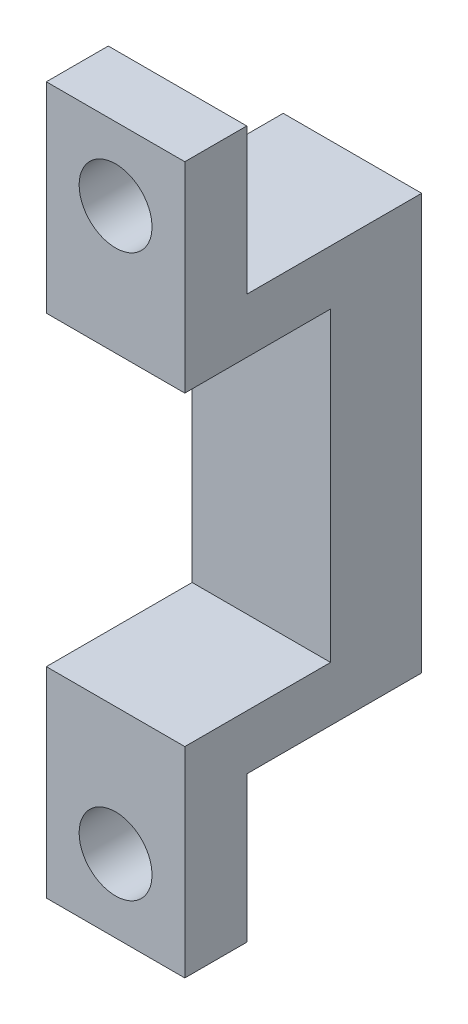
ISO-10303-21;
HEADER;
FILE_DESCRIPTION(('STEP AP214'),'2;1');
FILE_NAME('part.step','',(''),(''),'','','');
FILE_SCHEMA(('AUTOMOTIVE_DESIGN { 1 0 10303 214 1 1 1 1 }'));
ENDSEC;
DATA;
#1=APPLICATION_CONTEXT('core data for automotive mechanical design processes');
#2=APPLICATION_PROTOCOL_DEFINITION('international standard','automotive_design',2000,#1);
#3=PRODUCT_CONTEXT('',#1,'mechanical');
#4=PRODUCT('Part','Part','',(#3));
#5=PRODUCT_RELATED_PRODUCT_CATEGORY('part','',(#4));
#6=PRODUCT_DEFINITION_FORMATION('','',#4);
#7=PRODUCT_DEFINITION_CONTEXT('part definition',#1,'design');
#8=PRODUCT_DEFINITION('design','',#6,#7);
#9=PRODUCT_DEFINITION_SHAPE('','',#8);
#10=(LENGTH_UNIT() NAMED_UNIT(*) SI_UNIT(.MILLI.,.METRE.));
#11=(NAMED_UNIT(*) PLANE_ANGLE_UNIT() SI_UNIT($,.RADIAN.));
#12=(NAMED_UNIT(*) SI_UNIT($,.STERADIAN.) SOLID_ANGLE_UNIT());
#13=UNCERTAINTY_MEASURE_WITH_UNIT(LENGTH_MEASURE(1.E-05),#10,'distance_accuracy_value','');
#14=(GEOMETRIC_REPRESENTATION_CONTEXT(3) GLOBAL_UNCERTAINTY_ASSIGNED_CONTEXT((#13)) GLOBAL_UNIT_ASSIGNED_CONTEXT((#10,
#11,#12)) REPRESENTATION_CONTEXT('',''));
#15=CARTESIAN_POINT('',(0.,0.,0.));
#16=DIRECTION('',(0.,0.,1.));
#17=DIRECTION('',(1.,0.,0.));
#18=AXIS2_PLACEMENT_3D('',#15,#16,#17);
#19=CARTESIAN_POINT('',(-9.5,28.5,12.5));
#20=DIRECTION('',(0.,-1.,0.));
#21=DIRECTION('',(0.,0.,-1.));
#22=AXIS2_PLACEMENT_3D('',#19,#20,#21);
#23=PLANE('',#22);
#24=DIRECTION('',(-1.,0.,0.));
#25=VECTOR('',#24,1.);
#26=CARTESIAN_POINT('',(-9.5,28.5,24.));
#27=LINE('',#26,#25);
#28=CARTESIAN_POINT('',(9.5,28.5,24.));
#29=VERTEX_POINT('',#28);
#30=CARTESIAN_POINT('',(-9.5,28.5,24.));
#31=VERTEX_POINT('',#30);
#32=EDGE_CURVE('E52',#29,#31,#27,.T.);
#33=ORIENTED_EDGE('',*,*,#32,.F.);
#34=DIRECTION('',(0.,0.,-1.));
#35=VECTOR('',#34,1.);
#36=CARTESIAN_POINT('',(9.5,28.5,12.5));
#37=LINE('',#36,#35);
#38=CARTESIAN_POINT('',(9.5,28.5,0.));
#39=VERTEX_POINT('',#38);
#40=EDGE_CURVE('E45',#29,#39,#37,.T.);
#41=ORIENTED_EDGE('',*,*,#40,.T.);
#42=DIRECTION('',(-1.,0.,0.));
#43=VECTOR('',#42,1.);
#44=CARTESIAN_POINT('',(-9.5,28.5,0.));
#45=LINE('',#44,#43);
#46=CARTESIAN_POINT('',(-9.5,28.5,0.));
#47=VERTEX_POINT('',#46);
#48=EDGE_CURVE('E218',#39,#47,#45,.T.);
#49=ORIENTED_EDGE('',*,*,#48,.T.);
#50=DIRECTION('',(0.,0.,-1.));
#51=VECTOR('',#50,1.);
#52=CARTESIAN_POINT('',(-9.5,28.5,12.5));
#53=LINE('',#52,#51);
#54=EDGE_CURVE('E223',#31,#47,#53,.T.);
#55=ORIENTED_EDGE('',*,*,#54,.F.);
#56=EDGE_LOOP('',(#33,#41,#49,#55));
#57=FACE_BOUND('',#56,.T.);
#58=ADVANCED_FACE('F37',(#57),#23,.F.);
#59=CARTESIAN_POINT('',(9.50000000000001,-28.5,12.5));
#60=DIRECTION('',(0.,1.,0.));
#61=DIRECTION('',(-1.,0.,0.));
#62=AXIS2_PLACEMENT_3D('',#59,#60,#61);
#63=PLANE('',#62);
#64=DIRECTION('',(1.,0.,0.));
#65=VECTOR('',#64,1.);
#66=CARTESIAN_POINT('',(-9.5,-28.5,24.));
#67=LINE('',#66,#65);
#68=CARTESIAN_POINT('',(-9.5,-28.5,24.));
#69=VERTEX_POINT('',#68);
#70=CARTESIAN_POINT('',(9.50000000000001,-28.5,24.));
#71=VERTEX_POINT('',#70);
#72=EDGE_CURVE('E60',#69,#71,#67,.T.);
#73=ORIENTED_EDGE('',*,*,#72,.F.);
#74=DIRECTION('',(0.,0.,-1.));
#75=VECTOR('',#74,1.);
#76=CARTESIAN_POINT('',(-9.5,-28.5,12.5));
#77=LINE('',#76,#75);
#78=CARTESIAN_POINT('',(-9.5,-28.5,0.));
#79=VERTEX_POINT('',#78);
#80=EDGE_CURVE('E212',#69,#79,#77,.T.);
#81=ORIENTED_EDGE('',*,*,#80,.T.);
#82=DIRECTION('',(1.,0.,0.));
#83=VECTOR('',#82,1.);
#84=CARTESIAN_POINT('',(9.50000000000001,-28.5,0.));
#85=LINE('',#84,#83);
#86=CARTESIAN_POINT('',(9.50000000000001,-28.5,0.));
#87=VERTEX_POINT('',#86);
#88=EDGE_CURVE('E206',#79,#87,#85,.T.);
#89=ORIENTED_EDGE('',*,*,#88,.T.);
#90=DIRECTION('',(0.,0.,-1.));
#91=VECTOR('',#90,1.);
#92=CARTESIAN_POINT('',(9.50000000000001,-28.5,12.5));
#93=LINE('',#92,#91);
#94=EDGE_CURVE('E11',#71,#87,#93,.T.);
#95=ORIENTED_EDGE('',*,*,#94,.F.);
#96=EDGE_LOOP('',(#73,#81,#89,#95));
#97=FACE_BOUND('',#96,.T.);
#98=ADVANCED_FACE('F39',(#97),#63,.F.);
#99=CARTESIAN_POINT('',(0.,0.,12.5));
#100=DIRECTION('',(0.,0.,-1.));
#101=DIRECTION('',(-1.,0.,0.));
#102=AXIS2_PLACEMENT_3D('',#99,#100,#101);
#103=PLANE('',#102);
#104=DIRECTION('',(1.,0.,0.));
#105=VECTOR('',#104,1.);
#106=CARTESIAN_POINT('',(9.50000000000001,21.,12.5));
#107=LINE('',#106,#105);
#108=CARTESIAN_POINT('',(-9.5,21.,12.5));
#109=VERTEX_POINT('',#108);
#110=CARTESIAN_POINT('',(9.5,21.,12.5));
#111=VERTEX_POINT('',#110);
#112=EDGE_CURVE('E136',#109,#111,#107,.T.);
#113=ORIENTED_EDGE('',*,*,#112,.F.);
#114=DIRECTION('',(0.,-1.,0.));
#115=VECTOR('',#114,1.);
#116=CARTESIAN_POINT('',(-9.5,-28.5,12.5));
#117=LINE('',#116,#115);
#118=CARTESIAN_POINT('',(-9.5,-21.,12.5));
#119=VERTEX_POINT('',#118);
#120=EDGE_CURVE('E209',#109,#119,#117,.T.);
#121=ORIENTED_EDGE('',*,*,#120,.T.);
#122=DIRECTION('',(-1.,0.,0.));
#123=VECTOR('',#122,1.);
#124=CARTESIAN_POINT('',(-9.5,-21.,12.5));
#125=LINE('',#124,#123);
#126=CARTESIAN_POINT('',(9.50000000000001,-21.,12.5));
#127=VERTEX_POINT('',#126);
#128=EDGE_CURVE('E189',#127,#119,#125,.T.);
#129=ORIENTED_EDGE('',*,*,#128,.F.);
#130=DIRECTION('',(0.,1.,0.));
#131=VECTOR('',#130,1.);
#132=CARTESIAN_POINT('',(9.5,28.5,12.5));
#133=LINE('',#132,#131);
#134=EDGE_CURVE('E207',#127,#111,#133,.T.);
#135=ORIENTED_EDGE('',*,*,#134,.T.);
#136=EDGE_LOOP('',(#113,#121,#129,#135));
#137=FACE_BOUND('',#136,.T.);
#138=ADVANCED_FACE('F243',(#137),#103,.F.);
#139=CARTESIAN_POINT('',(9.5,28.5,12.5));
#140=DIRECTION('',(-1.,0.,0.));
#141=DIRECTION('',(0.,-1.,0.));
#142=AXIS2_PLACEMENT_3D('',#139,#140,#141);
#143=PLANE('',#142);
#144=DIRECTION('',(0.,1.,0.));
#145=VECTOR('',#144,1.);
#146=CARTESIAN_POINT('',(9.5,28.5,0.));
#147=LINE('',#146,#145);
#148=EDGE_CURVE('E215',#87,#39,#147,.T.);
#149=ORIENTED_EDGE('',*,*,#148,.T.);
#150=ORIENTED_EDGE('',*,*,#40,.F.);
#151=DIRECTION('',(0.,-1.,0.));
#152=VECTOR('',#151,1.);
#153=CARTESIAN_POINT('',(9.50000000000001,48.5,24.));
#154=LINE('',#153,#152);
#155=CARTESIAN_POINT('',(9.50000000000001,48.5,24.));
#156=VERTEX_POINT('',#155);
#157=EDGE_CURVE('E162',#156,#29,#154,.T.);
#158=ORIENTED_EDGE('',*,*,#157,.F.);
#159=DIRECTION('',(0.,0.,-1.));
#160=VECTOR('',#159,1.);
#161=CARTESIAN_POINT('',(9.50000000000001,48.5,24.));
#162=LINE('',#161,#160);
#163=CARTESIAN_POINT('',(9.50000000000001,48.5,32.5));
#164=VERTEX_POINT('',#163);
#165=EDGE_CURVE('E146',#164,#156,#162,.T.);
#166=ORIENTED_EDGE('',*,*,#165,.F.);
#167=DIRECTION('',(0.,1.,0.));
#168=VECTOR('',#167,1.);
#169=CARTESIAN_POINT('',(9.50000000000001,28.5,32.5));
#170=LINE('',#169,#168);
#171=CARTESIAN_POINT('',(9.50000000000001,21.,32.5));
#172=VERTEX_POINT('',#171);
#173=EDGE_CURVE('E143',#172,#164,#170,.T.);
#174=ORIENTED_EDGE('',*,*,#173,.F.);
#175=DIRECTION('',(0.,0.,-1.));
#176=VECTOR('',#175,1.);
#177=CARTESIAN_POINT('',(9.50000000000001,21.,32.5));
#178=LINE('',#177,#176);
#179=EDGE_CURVE('E184',#172,#111,#178,.T.);
#180=ORIENTED_EDGE('',*,*,#179,.T.);
#181=ORIENTED_EDGE('',*,*,#134,.F.);
#182=DIRECTION('',(0.,0.,-1.));
#183=VECTOR('',#182,1.);
#184=CARTESIAN_POINT('',(9.50000000000001,-21.,32.5));
#185=LINE('',#184,#183);
#186=CARTESIAN_POINT('',(9.50000000000001,-21.,32.5));
#187=VERTEX_POINT('',#186);
#188=EDGE_CURVE('E203',#187,#127,#185,.T.);
#189=ORIENTED_EDGE('',*,*,#188,.F.);
#190=DIRECTION('',(0.,1.,0.));
#191=VECTOR('',#190,1.);
#192=CARTESIAN_POINT('',(9.50000000000001,-21.,32.5));
#193=LINE('',#192,#191);
#194=CARTESIAN_POINT('',(9.50000000000002,-48.5,32.5));
#195=VERTEX_POINT('',#194);
#196=EDGE_CURVE('E194',#195,#187,#193,.T.);
#197=ORIENTED_EDGE('',*,*,#196,.F.);
#198=DIRECTION('',(0.,0.,1.));
#199=VECTOR('',#198,1.);
#200=CARTESIAN_POINT('',(9.50000000000002,-48.5,24.));
#201=LINE('',#200,#199);
#202=CARTESIAN_POINT('',(9.50000000000002,-48.5,24.));
#203=VERTEX_POINT('',#202);
#204=EDGE_CURVE('E170',#203,#195,#201,.T.);
#205=ORIENTED_EDGE('',*,*,#204,.F.);
#206=DIRECTION('',(0.,1.,0.));
#207=VECTOR('',#206,1.);
#208=CARTESIAN_POINT('',(9.50000000000002,-48.5,24.));
#209=LINE('',#208,#207);
#210=EDGE_CURVE('E176',#203,#71,#209,.T.);
#211=ORIENTED_EDGE('',*,*,#210,.T.);
#212=ORIENTED_EDGE('',*,*,#94,.T.);
#213=EDGE_LOOP('',(#149,#150,#158,#166,#174,#180,#181,#189,#197,#205,#211,#212));
#214=FACE_BOUND('',#213,.T.);
#215=ADVANCED_FACE('F229',(#214),#143,.F.);
#216=CARTESIAN_POINT('',(-9.5,-28.5,12.5));
#217=DIRECTION('',(1.,0.,0.));
#218=DIRECTION('',(0.,1.,0.));
#219=AXIS2_PLACEMENT_3D('',#216,#217,#218);
#220=PLANE('',#219);
#221=DIRECTION('',(0.,-1.,0.));
#222=VECTOR('',#221,1.);
#223=CARTESIAN_POINT('',(-9.5,-28.5,0.));
#224=LINE('',#223,#222);
#225=EDGE_CURVE('E210',#47,#79,#224,.T.);
#226=ORIENTED_EDGE('',*,*,#225,.T.);
#227=ORIENTED_EDGE('',*,*,#80,.F.);
#228=DIRECTION('',(0.,1.,0.));
#229=VECTOR('',#228,1.);
#230=CARTESIAN_POINT('',(-9.49999999999999,-48.5,24.));
#231=LINE('',#230,#229);
#232=CARTESIAN_POINT('',(-9.49999999999999,-48.5,24.));
#233=VERTEX_POINT('',#232);
#234=EDGE_CURVE('E180',#233,#69,#231,.T.);
#235=ORIENTED_EDGE('',*,*,#234,.F.);
#236=DIRECTION('',(0.,0.,-1.));
#237=VECTOR('',#236,1.);
#238=CARTESIAN_POINT('',(-9.49999999999999,-48.5,32.5));
#239=LINE('',#238,#237);
#240=CARTESIAN_POINT('',(-9.49999999999999,-48.5,32.5));
#241=VERTEX_POINT('',#240);
#242=EDGE_CURVE('E165',#241,#233,#239,.T.);
#243=ORIENTED_EDGE('',*,*,#242,.F.);
#244=DIRECTION('',(0.,-1.,0.));
#245=VECTOR('',#244,1.);
#246=CARTESIAN_POINT('',(-9.5,-28.5,32.5));
#247=LINE('',#246,#245);
#248=CARTESIAN_POINT('',(-9.5,-21.,32.5));
#249=VERTEX_POINT('',#248);
#250=EDGE_CURVE('E192',#249,#241,#247,.T.);
#251=ORIENTED_EDGE('',*,*,#250,.F.);
#252=DIRECTION('',(0.,0.,-1.));
#253=VECTOR('',#252,1.);
#254=CARTESIAN_POINT('',(-9.5,-21.,32.5));
#255=LINE('',#254,#253);
#256=EDGE_CURVE('E198',#249,#119,#255,.T.);
#257=ORIENTED_EDGE('',*,*,#256,.T.);
#258=ORIENTED_EDGE('',*,*,#120,.F.);
#259=DIRECTION('',(0.,0.,-1.));
#260=VECTOR('',#259,1.);
#261=CARTESIAN_POINT('',(-9.5,21.,32.5));
#262=LINE('',#261,#260);
#263=CARTESIAN_POINT('',(-9.5,21.,32.5));
#264=VERTEX_POINT('',#263);
#265=EDGE_CURVE('E134',#264,#109,#262,.T.);
#266=ORIENTED_EDGE('',*,*,#265,.F.);
#267=DIRECTION('',(0.,-1.,0.));
#268=VECTOR('',#267,1.);
#269=CARTESIAN_POINT('',(-9.5,21.,32.5));
#270=LINE('',#269,#268);
#271=CARTESIAN_POINT('',(-9.5,48.5,32.5));
#272=VERTEX_POINT('',#271);
#273=EDGE_CURVE('E126',#272,#264,#270,.T.);
#274=ORIENTED_EDGE('',*,*,#273,.F.);
#275=DIRECTION('',(0.,0.,1.));
#276=VECTOR('',#275,1.);
#277=CARTESIAN_POINT('',(-9.5,48.5,32.5));
#278=LINE('',#277,#276);
#279=CARTESIAN_POINT('',(-9.5,48.5,24.));
#280=VERTEX_POINT('',#279);
#281=EDGE_CURVE('E132',#280,#272,#278,.T.);
#282=ORIENTED_EDGE('',*,*,#281,.F.);
#283=DIRECTION('',(0.,-1.,0.));
#284=VECTOR('',#283,1.);
#285=CARTESIAN_POINT('',(-9.5,48.5,24.));
#286=LINE('',#285,#284);
#287=EDGE_CURVE('E159',#280,#31,#286,.T.);
#288=ORIENTED_EDGE('',*,*,#287,.T.);
#289=ORIENTED_EDGE('',*,*,#54,.T.);
#290=EDGE_LOOP('',(#226,#227,#235,#243,#251,#257,#258,#266,#274,#282,#288,#289));
#291=FACE_BOUND('',#290,.T.);
#292=ADVANCED_FACE('F129',(#291),#220,.F.);
#293=CARTESIAN_POINT('',(0.,0.,0.));
#294=DIRECTION('',(0.,0.,-1.));
#295=DIRECTION('',(-1.,0.,0.));
#296=AXIS2_PLACEMENT_3D('',#293,#294,#295);
#297=PLANE('',#296);
#298=ORIENTED_EDGE('',*,*,#88,.F.);
#299=ORIENTED_EDGE('',*,*,#225,.F.);
#300=ORIENTED_EDGE('',*,*,#48,.F.);
#301=ORIENTED_EDGE('',*,*,#148,.F.);
#302=EDGE_LOOP('',(#298,#299,#300,#301));
#303=FACE_BOUND('',#302,.T.);
#304=ADVANCED_FACE('F232',(#303),#297,.T.);
#305=CARTESIAN_POINT('',(-9.5,-21.,32.5));
#306=DIRECTION('',(0.,-1.,0.));
#307=DIRECTION('',(0.,0.,-1.));
#308=AXIS2_PLACEMENT_3D('',#305,#306,#307);
#309=PLANE('',#308);
#310=ORIENTED_EDGE('',*,*,#128,.T.);
#311=ORIENTED_EDGE('',*,*,#256,.F.);
#312=DIRECTION('',(-1.,0.,0.));
#313=VECTOR('',#312,1.);
#314=CARTESIAN_POINT('',(-9.5,-21.,32.5));
#315=LINE('',#314,#313);
#316=EDGE_CURVE('E196',#187,#249,#315,.T.);
#317=ORIENTED_EDGE('',*,*,#316,.F.);
#318=ORIENTED_EDGE('',*,*,#188,.T.);
#319=EDGE_LOOP('',(#310,#311,#317,#318));
#320=FACE_BOUND('',#319,.T.);
#321=ADVANCED_FACE('F246',(#320),#309,.F.);
#322=CARTESIAN_POINT('',(0.,0.,32.5));
#323=DIRECTION('',(0.,0.,-1.));
#324=DIRECTION('',(-1.,0.,0.));
#325=AXIS2_PLACEMENT_3D('',#322,#323,#324);
#326=PLANE('',#325);
#327=CARTESIAN_POINT('',(0.,-38.5,32.5));
#328=DIRECTION('',(0.,0.,-1.));
#329=DIRECTION('',(-1.,0.,0.));
#330=AXIS2_PLACEMENT_3D('',#327,#328,#329);
#331=CIRCLE('',#330,5.00000000000001);
#332=CARTESIAN_POINT('',(-5.00000000000001,-38.5,32.5));
#333=VERTEX_POINT('',#332);
#334=EDGE_CURVE('E153',#333,#333,#331,.T.);
#335=ORIENTED_EDGE('',*,*,#334,.T.);
#336=EDGE_LOOP('',(#335));
#337=FACE_BOUND('',#336,.T.);
#338=ORIENTED_EDGE('',*,*,#250,.T.);
#339=DIRECTION('',(-1.,0.,0.));
#340=VECTOR('',#339,1.);
#341=CARTESIAN_POINT('',(9.50000000000002,-48.5,32.5));
#342=LINE('',#341,#340);
#343=EDGE_CURVE('E173',#195,#241,#342,.T.);
#344=ORIENTED_EDGE('',*,*,#343,.F.);
#345=ORIENTED_EDGE('',*,*,#196,.T.);
#346=ORIENTED_EDGE('',*,*,#316,.T.);
#347=EDGE_LOOP('',(#338,#344,#345,#346));
#348=FACE_BOUND('',#347,.T.);
#349=ADVANCED_FACE('F252',(#337,#348),#326,.F.);
#350=CARTESIAN_POINT('',(9.50000000000001,21.,32.5));
#351=DIRECTION('',(0.,1.,0.));
#352=DIRECTION('',(-1.,0.,0.));
#353=AXIS2_PLACEMENT_3D('',#350,#351,#352);
#354=PLANE('',#353);
#355=ORIENTED_EDGE('',*,*,#112,.T.);
#356=ORIENTED_EDGE('',*,*,#179,.F.);
#357=DIRECTION('',(1.,0.,0.));
#358=VECTOR('',#357,1.);
#359=CARTESIAN_POINT('',(9.50000000000001,21.,32.5));
#360=LINE('',#359,#358);
#361=EDGE_CURVE('E137',#264,#172,#360,.T.);
#362=ORIENTED_EDGE('',*,*,#361,.F.);
#363=ORIENTED_EDGE('',*,*,#265,.T.);
#364=EDGE_LOOP('',(#355,#356,#362,#363));
#365=FACE_BOUND('',#364,.T.);
#366=ADVANCED_FACE('F240',(#365),#354,.F.);
#367=CARTESIAN_POINT('',(0.,0.,32.5));
#368=DIRECTION('',(0.,0.,-1.));
#369=DIRECTION('',(-1.,0.,0.));
#370=AXIS2_PLACEMENT_3D('',#367,#368,#369);
#371=PLANE('',#370);
#372=CARTESIAN_POINT('',(0.,38.5,32.5));
#373=DIRECTION('',(0.,0.,-1.));
#374=DIRECTION('',(-1.,0.,0.));
#375=AXIS2_PLACEMENT_3D('',#372,#373,#374);
#376=CIRCLE('',#375,5.);
#377=CARTESIAN_POINT('',(-5.,38.5,32.5));
#378=VERTEX_POINT('',#377);
#379=EDGE_CURVE('E302',#378,#378,#376,.T.);
#380=ORIENTED_EDGE('',*,*,#379,.T.);
#381=EDGE_LOOP('',(#380));
#382=FACE_BOUND('',#381,.T.);
#383=ORIENTED_EDGE('',*,*,#273,.T.);
#384=ORIENTED_EDGE('',*,*,#361,.T.);
#385=ORIENTED_EDGE('',*,*,#173,.T.);
#386=DIRECTION('',(1.,0.,0.));
#387=VECTOR('',#386,1.);
#388=CARTESIAN_POINT('',(9.50000000000001,48.5,32.5));
#389=LINE('',#388,#387);
#390=EDGE_CURVE('E140',#272,#164,#389,.T.);
#391=ORIENTED_EDGE('',*,*,#390,.F.);
#392=EDGE_LOOP('',(#383,#384,#385,#391));
#393=FACE_BOUND('',#392,.T.);
#394=ADVANCED_FACE('F141',(#382,#393),#371,.F.);
#395=CARTESIAN_POINT('',(-9.49999999999999,-48.5,24.));
#396=DIRECTION('',(0.,0.,1.));
#397=DIRECTION('',(1.,0.,0.));
#398=AXIS2_PLACEMENT_3D('',#395,#396,#397);
#399=PLANE('',#398);
#400=CARTESIAN_POINT('',(0.,-38.5,24.));
#401=DIRECTION('',(0.,0.,-1.));
#402=DIRECTION('',(-1.,0.,0.));
#403=AXIS2_PLACEMENT_3D('',#400,#401,#402);
#404=CIRCLE('',#403,5.00000000000001);
#405=CARTESIAN_POINT('',(-5.00000000000001,-38.5,24.));
#406=VERTEX_POINT('',#405);
#407=EDGE_CURVE('E307',#406,#406,#404,.T.);
#408=ORIENTED_EDGE('',*,*,#407,.F.);
#409=EDGE_LOOP('',(#408));
#410=FACE_BOUND('',#409,.T.);
#411=ORIENTED_EDGE('',*,*,#72,.T.);
#412=ORIENTED_EDGE('',*,*,#210,.F.);
#413=DIRECTION('',(1.,0.,0.));
#414=VECTOR('',#413,1.);
#415=CARTESIAN_POINT('',(-9.49999999999999,-48.5,24.));
#416=LINE('',#415,#414);
#417=EDGE_CURVE('E168',#233,#203,#416,.T.);
#418=ORIENTED_EDGE('',*,*,#417,.F.);
#419=ORIENTED_EDGE('',*,*,#234,.T.);
#420=EDGE_LOOP('',(#411,#412,#418,#419));
#421=FACE_BOUND('',#420,.T.);
#422=ADVANCED_FACE('F258',(#410,#421),#399,.F.);
#423=CARTESIAN_POINT('',(0.,-48.5,0.));
#424=DIRECTION('',(0.,-1.,0.));
#425=DIRECTION('',(1.,0.,0.));
#426=AXIS2_PLACEMENT_3D('',#423,#424,#425);
#427=PLANE('',#426);
#428=ORIENTED_EDGE('',*,*,#242,.T.);
#429=ORIENTED_EDGE('',*,*,#417,.T.);
#430=ORIENTED_EDGE('',*,*,#204,.T.);
#431=ORIENTED_EDGE('',*,*,#343,.T.);
#432=EDGE_LOOP('',(#428,#429,#430,#431));
#433=FACE_BOUND('',#432,.T.);
#434=ADVANCED_FACE('F254',(#433),#427,.T.);
#435=CARTESIAN_POINT('',(-9.5,48.5,24.));
#436=DIRECTION('',(0.,0.,1.));
#437=DIRECTION('',(1.,0.,0.));
#438=AXIS2_PLACEMENT_3D('',#435,#436,#437);
#439=PLANE('',#438);
#440=CARTESIAN_POINT('',(0.,38.5,24.));
#441=DIRECTION('',(0.,0.,-1.));
#442=DIRECTION('',(-1.,0.,0.));
#443=AXIS2_PLACEMENT_3D('',#440,#441,#442);
#444=CIRCLE('',#443,5.);
#445=CARTESIAN_POINT('',(-5.,38.5,24.));
#446=VERTEX_POINT('',#445);
#447=EDGE_CURVE('E304',#446,#446,#444,.T.);
#448=ORIENTED_EDGE('',*,*,#447,.F.);
#449=EDGE_LOOP('',(#448));
#450=FACE_BOUND('',#449,.T.);
#451=ORIENTED_EDGE('',*,*,#32,.T.);
#452=ORIENTED_EDGE('',*,*,#287,.F.);
#453=DIRECTION('',(-1.,0.,0.));
#454=VECTOR('',#453,1.);
#455=CARTESIAN_POINT('',(-9.5,48.5,24.));
#456=LINE('',#455,#454);
#457=EDGE_CURVE('E150',#156,#280,#456,.T.);
#458=ORIENTED_EDGE('',*,*,#457,.F.);
#459=ORIENTED_EDGE('',*,*,#157,.T.);
#460=EDGE_LOOP('',(#451,#452,#458,#459));
#461=FACE_BOUND('',#460,.T.);
#462=ADVANCED_FACE('F235',(#450,#461),#439,.F.);
#463=CARTESIAN_POINT('',(0.,48.5,0.));
#464=DIRECTION('',(0.,-1.,0.));
#465=DIRECTION('',(0.,0.,-1.));
#466=AXIS2_PLACEMENT_3D('',#463,#464,#465);
#467=PLANE('',#466);
#468=ORIENTED_EDGE('',*,*,#281,.T.);
#469=ORIENTED_EDGE('',*,*,#390,.T.);
#470=ORIENTED_EDGE('',*,*,#165,.T.);
#471=ORIENTED_EDGE('',*,*,#457,.T.);
#472=EDGE_LOOP('',(#468,#469,#470,#471));
#473=FACE_BOUND('',#472,.T.);
#474=ADVANCED_FACE('F148',(#473),#467,.F.);
#475=CARTESIAN_POINT('',(0.,38.5,44.));
#476=DIRECTION('',(0.,0.,-1.));
#477=DIRECTION('',(-1.,0.,0.));
#478=AXIS2_PLACEMENT_3D('',#475,#476,#477);
#479=CYLINDRICAL_SURFACE('',#478,5.);
#480=ORIENTED_EDGE('',*,*,#447,.T.);
#481=EDGE_LOOP('',(#480));
#482=FACE_BOUND('',#481,.T.);
#483=ORIENTED_EDGE('',*,*,#379,.F.);
#484=EDGE_LOOP('',(#483));
#485=FACE_BOUND('',#484,.T.);
#486=ADVANCED_FACE('F314',(#482,#485),#479,.F.);
#487=CARTESIAN_POINT('',(0.,-38.5,44.));
#488=DIRECTION('',(0.,0.,-1.));
#489=DIRECTION('',(-1.,0.,0.));
#490=AXIS2_PLACEMENT_3D('',#487,#488,#489);
#491=CYLINDRICAL_SURFACE('',#490,5.00000000000001);
#492=ORIENTED_EDGE('',*,*,#407,.T.);
#493=EDGE_LOOP('',(#492));
#494=FACE_BOUND('',#493,.T.);
#495=ORIENTED_EDGE('',*,*,#334,.F.);
#496=EDGE_LOOP('',(#495));
#497=FACE_BOUND('',#496,.T.);
#498=ADVANCED_FACE('F312',(#494,#497),#491,.F.);
#499=CLOSED_SHELL('',(#58,#98,#138,#215,#292,#304,#321,#349,#366,#394,#422,#434,#462,#474,#486,#498));
#500=MANIFOLD_SOLID_BREP('B2',#499);
#501=ADVANCED_BREP_SHAPE_REPRESENTATION('',(#18,#500),#14);
#502=SHAPE_DEFINITION_REPRESENTATION(#9,#501);
ENDSEC;
END-ISO-10303-21;
